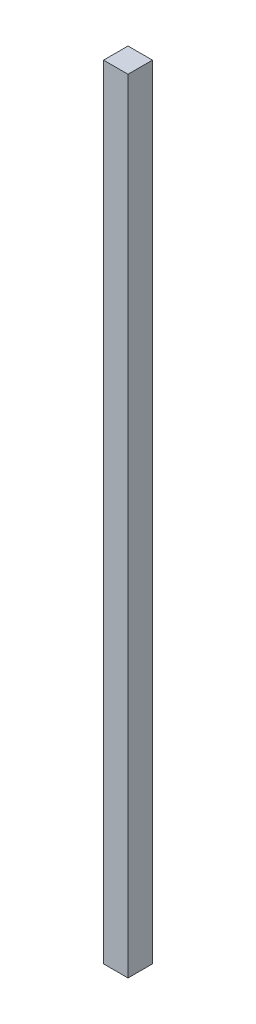
ISO-10303-21;
HEADER;
FILE_DESCRIPTION(('STEP AP214'),'2;1');
FILE_NAME('part.step','',(''),(''),'','','');
FILE_SCHEMA(('AUTOMOTIVE_DESIGN { 1 0 10303 214 1 1 1 1 }'));
ENDSEC;
DATA;
#1=APPLICATION_CONTEXT('core data for automotive mechanical design processes');
#2=APPLICATION_PROTOCOL_DEFINITION('international standard','automotive_design',2000,#1);
#3=PRODUCT_CONTEXT('',#1,'mechanical');
#4=PRODUCT('Part','Part','',(#3));
#5=PRODUCT_RELATED_PRODUCT_CATEGORY('part','',(#4));
#6=PRODUCT_DEFINITION_FORMATION('','',#4);
#7=PRODUCT_DEFINITION_CONTEXT('part definition',#1,'design');
#8=PRODUCT_DEFINITION('design','',#6,#7);
#9=PRODUCT_DEFINITION_SHAPE('','',#8);
#10=(LENGTH_UNIT() NAMED_UNIT(*) SI_UNIT(.MILLI.,.METRE.));
#11=(NAMED_UNIT(*) PLANE_ANGLE_UNIT() SI_UNIT($,.RADIAN.));
#12=(NAMED_UNIT(*) SI_UNIT($,.STERADIAN.) SOLID_ANGLE_UNIT());
#13=UNCERTAINTY_MEASURE_WITH_UNIT(LENGTH_MEASURE(1.E-05),#10,'distance_accuracy_value','');
#14=(GEOMETRIC_REPRESENTATION_CONTEXT(3) GLOBAL_UNCERTAINTY_ASSIGNED_CONTEXT((#13)) GLOBAL_UNIT_ASSIGNED_CONTEXT((#10,
#11,#12)) REPRESENTATION_CONTEXT('',''));
#15=CARTESIAN_POINT('',(0.,0.,0.));
#16=DIRECTION('',(0.,0.,1.));
#17=DIRECTION('',(1.,0.,0.));
#18=AXIS2_PLACEMENT_3D('',#15,#16,#17);
#19=CARTESIAN_POINT('',(3.175,203.2,3.175));
#20=DIRECTION('',(-1.,0.,0.));
#21=DIRECTION('',(0.,0.,1.));
#22=AXIS2_PLACEMENT_3D('',#19,#20,#21);
#23=PLANE('',#22);
#24=DIRECTION('',(0.,0.,-1.));
#25=VECTOR('',#24,1.);
#26=CARTESIAN_POINT('',(3.175,0.,3.175));
#27=LINE('',#26,#25);
#28=CARTESIAN_POINT('',(3.175,0.,3.175));
#29=VERTEX_POINT('',#28);
#30=CARTESIAN_POINT('',(3.175,0.,-3.175));
#31=VERTEX_POINT('',#30);
#32=EDGE_CURVE('E102',#29,#31,#27,.T.);
#33=ORIENTED_EDGE('',*,*,#32,.T.);
#34=DIRECTION('',(0.,-1.,0.));
#35=VECTOR('',#34,1.);
#36=CARTESIAN_POINT('',(3.175,203.2,-3.175));
#37=LINE('',#36,#35);
#38=CARTESIAN_POINT('',(3.175,203.2,-3.175));
#39=VERTEX_POINT('',#38);
#40=EDGE_CURVE('E11',#39,#31,#37,.T.);
#41=ORIENTED_EDGE('',*,*,#40,.F.);
#42=DIRECTION('',(0.,0.,-1.));
#43=VECTOR('',#42,1.);
#44=CARTESIAN_POINT('',(3.175,203.2,3.175));
#45=LINE('',#44,#43);
#46=CARTESIAN_POINT('',(3.175,203.2,3.175));
#47=VERTEX_POINT('',#46);
#48=EDGE_CURVE('E90',#47,#39,#45,.T.);
#49=ORIENTED_EDGE('',*,*,#48,.F.);
#50=DIRECTION('',(0.,-1.,0.));
#51=VECTOR('',#50,1.);
#52=CARTESIAN_POINT('',(3.175,203.2,3.175));
#53=LINE('',#52,#51);
#54=EDGE_CURVE('E98',#47,#29,#53,.T.);
#55=ORIENTED_EDGE('',*,*,#54,.T.);
#56=EDGE_LOOP('',(#33,#41,#49,#55));
#57=FACE_BOUND('',#56,.T.);
#58=ADVANCED_FACE('F39',(#57),#23,.F.);
#59=CARTESIAN_POINT('',(-3.175,203.2,-3.175));
#60=DIRECTION('',(0.,0.,1.));
#61=DIRECTION('',(1.,0.,0.));
#62=AXIS2_PLACEMENT_3D('',#59,#60,#61);
#63=PLANE('',#62);
#64=DIRECTION('',(-1.,0.,0.));
#65=VECTOR('',#64,1.);
#66=CARTESIAN_POINT('',(-3.175,0.,-3.175));
#67=LINE('',#66,#65);
#68=CARTESIAN_POINT('',(-3.175,0.,-3.175));
#69=VERTEX_POINT('',#68);
#70=EDGE_CURVE('E94',#31,#69,#67,.T.);
#71=ORIENTED_EDGE('',*,*,#70,.T.);
#72=DIRECTION('',(0.,-1.,0.));
#73=VECTOR('',#72,1.);
#74=CARTESIAN_POINT('',(-3.175,203.2,-3.175));
#75=LINE('',#74,#73);
#76=CARTESIAN_POINT('',(-3.175,203.2,-3.175));
#77=VERTEX_POINT('',#76);
#78=EDGE_CURVE('E47',#77,#69,#75,.T.);
#79=ORIENTED_EDGE('',*,*,#78,.F.);
#80=DIRECTION('',(-1.,0.,0.));
#81=VECTOR('',#80,1.);
#82=CARTESIAN_POINT('',(-3.175,203.2,-3.175));
#83=LINE('',#82,#81);
#84=EDGE_CURVE('E85',#39,#77,#83,.T.);
#85=ORIENTED_EDGE('',*,*,#84,.F.);
#86=ORIENTED_EDGE('',*,*,#40,.T.);
#87=EDGE_LOOP('',(#71,#79,#85,#86));
#88=FACE_BOUND('',#87,.T.);
#89=ADVANCED_FACE('F93',(#88),#63,.F.);
#90=CARTESIAN_POINT('',(-3.175,203.2,3.175));
#91=DIRECTION('',(1.,0.,0.));
#92=DIRECTION('',(0.,0.,-1.));
#93=AXIS2_PLACEMENT_3D('',#90,#91,#92);
#94=PLANE('',#93);
#95=DIRECTION('',(0.,0.,1.));
#96=VECTOR('',#95,1.);
#97=CARTESIAN_POINT('',(-3.175,0.,3.175));
#98=LINE('',#97,#96);
#99=CARTESIAN_POINT('',(-3.175,0.,3.175));
#100=VERTEX_POINT('',#99);
#101=EDGE_CURVE('E72',#69,#100,#98,.T.);
#102=ORIENTED_EDGE('',*,*,#101,.T.);
#103=DIRECTION('',(0.,-1.,0.));
#104=VECTOR('',#103,1.);
#105=CARTESIAN_POINT('',(-3.175,203.2,3.175));
#106=LINE('',#105,#104);
#107=CARTESIAN_POINT('',(-3.175,203.2,3.175));
#108=VERTEX_POINT('',#107);
#109=EDGE_CURVE('E95',#108,#100,#106,.T.);
#110=ORIENTED_EDGE('',*,*,#109,.F.);
#111=DIRECTION('',(0.,0.,1.));
#112=VECTOR('',#111,1.);
#113=CARTESIAN_POINT('',(-3.175,203.2,3.175));
#114=LINE('',#113,#112);
#115=EDGE_CURVE('E88',#77,#108,#114,.T.);
#116=ORIENTED_EDGE('',*,*,#115,.F.);
#117=ORIENTED_EDGE('',*,*,#78,.T.);
#118=EDGE_LOOP('',(#102,#110,#116,#117));
#119=FACE_BOUND('',#118,.T.);
#120=ADVANCED_FACE('F96',(#119),#94,.F.);
#121=CARTESIAN_POINT('',(-3.175,203.2,3.175));
#122=DIRECTION('',(0.,0.,-1.));
#123=DIRECTION('',(-1.,0.,0.));
#124=AXIS2_PLACEMENT_3D('',#121,#122,#123);
#125=PLANE('',#124);
#126=DIRECTION('',(1.,0.,0.));
#127=VECTOR('',#126,1.);
#128=CARTESIAN_POINT('',(-3.175,0.,3.175));
#129=LINE('',#128,#127);
#130=EDGE_CURVE('E78',#100,#29,#129,.T.);
#131=ORIENTED_EDGE('',*,*,#130,.T.);
#132=ORIENTED_EDGE('',*,*,#54,.F.);
#133=DIRECTION('',(1.,0.,0.));
#134=VECTOR('',#133,1.);
#135=CARTESIAN_POINT('',(-3.175,203.2,3.175));
#136=LINE('',#135,#134);
#137=EDGE_CURVE('E55',#108,#47,#136,.T.);
#138=ORIENTED_EDGE('',*,*,#137,.F.);
#139=ORIENTED_EDGE('',*,*,#109,.T.);
#140=EDGE_LOOP('',(#131,#132,#138,#139));
#141=FACE_BOUND('',#140,.T.);
#142=ADVANCED_FACE('F109',(#141),#125,.F.);
#143=CARTESIAN_POINT('',(0.,203.2,0.));
#144=DIRECTION('',(0.,-1.,0.));
#145=DIRECTION('',(0.,0.,-1.));
#146=AXIS2_PLACEMENT_3D('',#143,#144,#145);
#147=PLANE('',#146);
#148=ORIENTED_EDGE('',*,*,#48,.T.);
#149=ORIENTED_EDGE('',*,*,#84,.T.);
#150=ORIENTED_EDGE('',*,*,#115,.T.);
#151=ORIENTED_EDGE('',*,*,#137,.T.);
#152=EDGE_LOOP('',(#148,#149,#150,#151));
#153=FACE_BOUND('',#152,.T.);
#154=ADVANCED_FACE('F86',(#153),#147,.F.);
#155=CARTESIAN_POINT('',(0.,0.,0.));
#156=DIRECTION('',(0.,-1.,0.));
#157=DIRECTION('',(0.,0.,-1.));
#158=AXIS2_PLACEMENT_3D('',#155,#156,#157);
#159=PLANE('',#158);
#160=ORIENTED_EDGE('',*,*,#32,.F.);
#161=ORIENTED_EDGE('',*,*,#130,.F.);
#162=ORIENTED_EDGE('',*,*,#101,.F.);
#163=ORIENTED_EDGE('',*,*,#70,.F.);
#164=EDGE_LOOP('',(#160,#161,#162,#163));
#165=FACE_BOUND('',#164,.T.);
#166=ADVANCED_FACE('F112',(#165),#159,.T.);
#167=CLOSED_SHELL('',(#58,#89,#120,#142,#154,#166));
#168=MANIFOLD_SOLID_BREP('B2',#167);
#169=ADVANCED_BREP_SHAPE_REPRESENTATION('',(#18,#168),#14);
#170=SHAPE_DEFINITION_REPRESENTATION(#9,#169);
ENDSEC;
END-ISO-10303-21;
